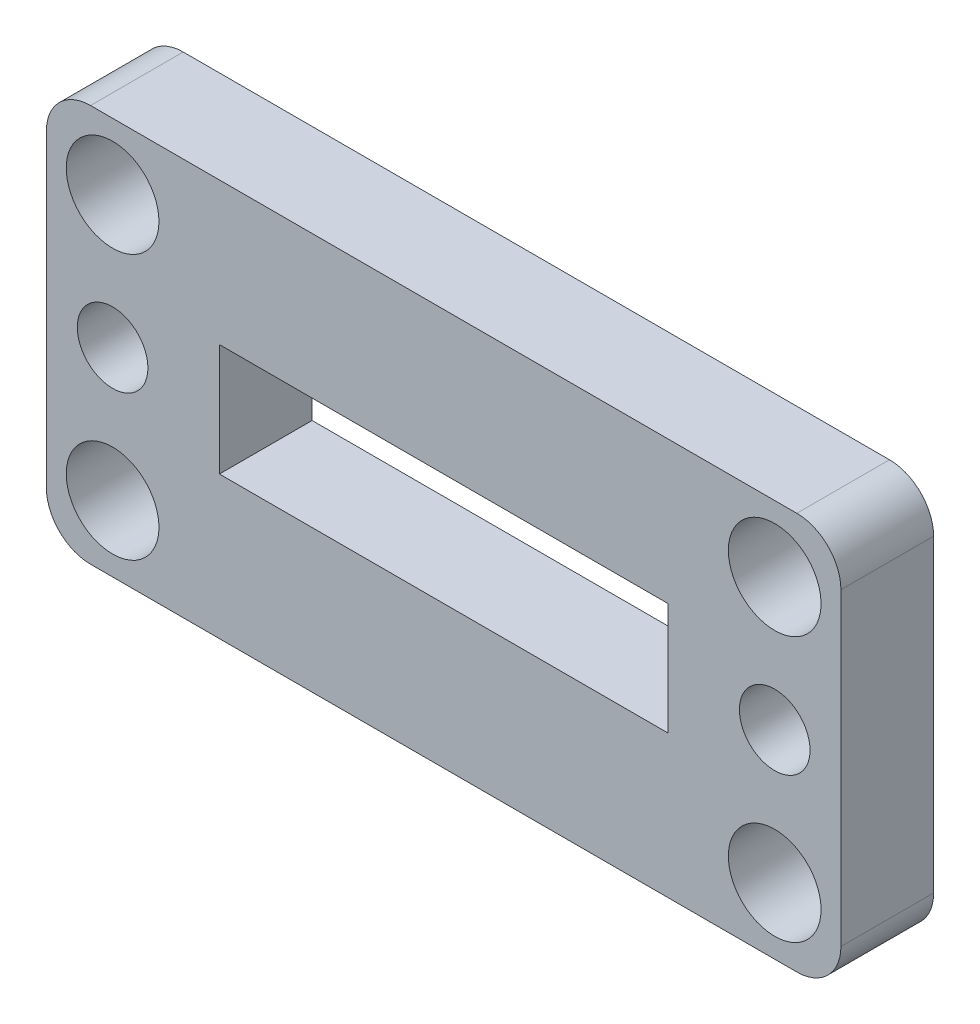
ISO-10303-21;
HEADER;
FILE_DESCRIPTION(('STEP AP214'),'2;1');
FILE_NAME('part.step','',(''),(''),'','','');
FILE_SCHEMA(('AUTOMOTIVE_DESIGN { 1 0 10303 214 1 1 1 1 }'));
ENDSEC;
DATA;
#1=APPLICATION_CONTEXT('core data for automotive mechanical design processes');
#2=APPLICATION_PROTOCOL_DEFINITION('international standard','automotive_design',2000,#1);
#3=PRODUCT_CONTEXT('',#1,'mechanical');
#4=PRODUCT('Part','Part','',(#3));
#5=PRODUCT_RELATED_PRODUCT_CATEGORY('part','',(#4));
#6=PRODUCT_DEFINITION_FORMATION('','',#4);
#7=PRODUCT_DEFINITION_CONTEXT('part definition',#1,'design');
#8=PRODUCT_DEFINITION('design','',#6,#7);
#9=PRODUCT_DEFINITION_SHAPE('','',#8);
#10=(LENGTH_UNIT() NAMED_UNIT(*) SI_UNIT(.MILLI.,.METRE.));
#11=(NAMED_UNIT(*) PLANE_ANGLE_UNIT() SI_UNIT($,.RADIAN.));
#12=(NAMED_UNIT(*) SI_UNIT($,.STERADIAN.) SOLID_ANGLE_UNIT());
#13=UNCERTAINTY_MEASURE_WITH_UNIT(LENGTH_MEASURE(1.E-05),#10,'distance_accuracy_value','');
#14=(GEOMETRIC_REPRESENTATION_CONTEXT(3) GLOBAL_UNCERTAINTY_ASSIGNED_CONTEXT((#13)) GLOBAL_UNIT_ASSIGNED_CONTEXT((#10,
#11,#12)) REPRESENTATION_CONTEXT('',''));
#15=CARTESIAN_POINT('',(0.,0.,0.));
#16=DIRECTION('',(0.,0.,1.));
#17=DIRECTION('',(1.,0.,0.));
#18=AXIS2_PLACEMENT_3D('',#15,#16,#17);
#19=CARTESIAN_POINT('',(16.,7.,4.2));
#20=DIRECTION('',(0.,0.,1.));
#21=DIRECTION('',(1.,0.,0.));
#22=AXIS2_PLACEMENT_3D('',#19,#20,#21);
#23=PLANE('',#22);
#24=CARTESIAN_POINT('',(-15.,-6.,4.2));
#25=DIRECTION('',(0.,0.,1.));
#26=DIRECTION('',(-1.,0.,0.));
#27=AXIS2_PLACEMENT_3D('',#24,#25,#26);
#28=CIRCLE('',#27,2.09999999999999);
#29=CARTESIAN_POINT('',(-17.1,-6.,4.2));
#30=VERTEX_POINT('',#29);
#31=EDGE_CURVE('E158',#30,#30,#28,.T.);
#32=ORIENTED_EDGE('',*,*,#31,.F.);
#33=EDGE_LOOP('',(#32));
#34=FACE_BOUND('',#33,.T.);
#35=CARTESIAN_POINT('',(15.,6.,4.2));
#36=DIRECTION('',(0.,0.,1.));
#37=DIRECTION('',(-1.,0.,0.));
#38=AXIS2_PLACEMENT_3D('',#35,#36,#37);
#39=CIRCLE('',#38,2.1);
#40=CARTESIAN_POINT('',(12.9,6.,4.2));
#41=VERTEX_POINT('',#40);
#42=EDGE_CURVE('E170',#41,#41,#39,.T.);
#43=ORIENTED_EDGE('',*,*,#42,.F.);
#44=EDGE_LOOP('',(#43));
#45=FACE_BOUND('',#44,.T.);
#46=CARTESIAN_POINT('',(14.9999999999864,3.40841457442923E-12,4.2));
#47=DIRECTION('',(0.,0.,1.));
#48=DIRECTION('',(1.,0.,0.));
#49=AXIS2_PLACEMENT_3D('',#46,#47,#48);
#50=CIRCLE('',#49,1.599999999999);
#51=CARTESIAN_POINT('',(16.5999999999854,3.40841457442923E-12,4.2));
#52=VERTEX_POINT('',#51);
#53=EDGE_CURVE('E182',#52,#52,#50,.T.);
#54=ORIENTED_EDGE('',*,*,#53,.F.);
#55=EDGE_LOOP('',(#54));
#56=FACE_BOUND('',#55,.T.);
#57=CARTESIAN_POINT('',(16.,7.,4.2));
#58=DIRECTION('',(0.,0.,1.));
#59=DIRECTION('',(1.,0.,0.));
#60=AXIS2_PLACEMENT_3D('',#57,#58,#59);
#61=CIRCLE('',#60,2.);
#62=CARTESIAN_POINT('',(18.,7.,4.2));
#63=VERTEX_POINT('',#62);
#64=CARTESIAN_POINT('',(16.,9.,4.2));
#65=VERTEX_POINT('',#64);
#66=EDGE_CURVE('E194',#63,#65,#61,.T.);
#67=ORIENTED_EDGE('',*,*,#66,.T.);
#68=DIRECTION('',(-1.,0.,0.));
#69=VECTOR('',#68,1.);
#70=CARTESIAN_POINT('',(16.,9.,4.2));
#71=LINE('',#70,#69);
#72=CARTESIAN_POINT('',(-16.,8.99999999999999,4.2));
#73=VERTEX_POINT('',#72);
#74=EDGE_CURVE('E197',#65,#73,#71,.T.);
#75=ORIENTED_EDGE('',*,*,#74,.T.);
#76=CARTESIAN_POINT('',(-16.,7.,4.2));
#77=DIRECTION('',(0.,0.,1.));
#78=DIRECTION('',(1.,0.,0.));
#79=AXIS2_PLACEMENT_3D('',#76,#77,#78);
#80=CIRCLE('',#79,2.);
#81=CARTESIAN_POINT('',(-18.,7.,4.2));
#82=VERTEX_POINT('',#81);
#83=EDGE_CURVE('E200',#73,#82,#80,.T.);
#84=ORIENTED_EDGE('',*,*,#83,.T.);
#85=DIRECTION('',(0.,-1.,0.));
#86=VECTOR('',#85,1.);
#87=CARTESIAN_POINT('',(-18.,-7.,4.2));
#88=LINE('',#87,#86);
#89=CARTESIAN_POINT('',(-18.,-7.,4.2));
#90=VERTEX_POINT('',#89);
#91=EDGE_CURVE('E202',#82,#90,#88,.T.);
#92=ORIENTED_EDGE('',*,*,#91,.T.);
#93=CARTESIAN_POINT('',(-16.,-7.,4.2));
#94=DIRECTION('',(0.,0.,1.));
#95=DIRECTION('',(1.,0.,0.));
#96=AXIS2_PLACEMENT_3D('',#93,#94,#95);
#97=CIRCLE('',#96,2.);
#98=CARTESIAN_POINT('',(-16.,-9.,4.2));
#99=VERTEX_POINT('',#98);
#100=EDGE_CURVE('E204',#90,#99,#97,.T.);
#101=ORIENTED_EDGE('',*,*,#100,.T.);
#102=DIRECTION('',(1.,0.,0.));
#103=VECTOR('',#102,1.);
#104=CARTESIAN_POINT('',(16.,-9.,4.2));
#105=LINE('',#104,#103);
#106=CARTESIAN_POINT('',(16.,-9.,4.2));
#107=VERTEX_POINT('',#106);
#108=EDGE_CURVE('E206',#99,#107,#105,.T.);
#109=ORIENTED_EDGE('',*,*,#108,.T.);
#110=CARTESIAN_POINT('',(16.,-7.,4.2));
#111=DIRECTION('',(0.,0.,1.));
#112=DIRECTION('',(1.,0.,0.));
#113=AXIS2_PLACEMENT_3D('',#110,#111,#112);
#114=CIRCLE('',#113,2.);
#115=CARTESIAN_POINT('',(18.,-7.,4.2));
#116=VERTEX_POINT('',#115);
#117=EDGE_CURVE('E208',#107,#116,#114,.T.);
#118=ORIENTED_EDGE('',*,*,#117,.T.);
#119=DIRECTION('',(0.,1.,0.));
#120=VECTOR('',#119,1.);
#121=CARTESIAN_POINT('',(18.,-7.,4.2));
#122=LINE('',#121,#120);
#123=EDGE_CURVE('E210',#116,#63,#122,.T.);
#124=ORIENTED_EDGE('',*,*,#123,.T.);
#125=EDGE_LOOP('',(#67,#75,#84,#92,#101,#109,#118,#124));
#126=FACE_BOUND('',#125,.T.);
#127=CARTESIAN_POINT('',(-14.9999999999864,3.40474063403179E-12,4.2));
#128=DIRECTION('',(0.,0.,1.));
#129=DIRECTION('',(1.,0.,0.));
#130=AXIS2_PLACEMENT_3D('',#127,#128,#129);
#131=CIRCLE('',#130,1.59999999999901);
#132=CARTESIAN_POINT('',(-13.3999999999873,3.40474063403179E-12,4.2));
#133=VERTEX_POINT('',#132);
#134=EDGE_CURVE('E188',#133,#133,#131,.T.);
#135=ORIENTED_EDGE('',*,*,#134,.F.);
#136=EDGE_LOOP('',(#135));
#137=FACE_BOUND('',#136,.T.);
#138=CARTESIAN_POINT('',(-15.,6.,4.2));
#139=DIRECTION('',(0.,0.,1.));
#140=DIRECTION('',(1.,0.,0.));
#141=AXIS2_PLACEMENT_3D('',#138,#139,#140);
#142=CIRCLE('',#141,2.1);
#143=CARTESIAN_POINT('',(-12.9,6.,4.2));
#144=VERTEX_POINT('',#143);
#145=EDGE_CURVE('E176',#144,#144,#142,.T.);
#146=ORIENTED_EDGE('',*,*,#145,.F.);
#147=EDGE_LOOP('',(#146));
#148=FACE_BOUND('',#147,.T.);
#149=CARTESIAN_POINT('',(15.,-5.99999999999999,4.2));
#150=DIRECTION('',(0.,0.,1.));
#151=DIRECTION('',(1.,0.,0.));
#152=AXIS2_PLACEMENT_3D('',#149,#150,#151);
#153=CIRCLE('',#152,2.1);
#154=CARTESIAN_POINT('',(17.1,-5.99999999999999,4.2));
#155=VERTEX_POINT('',#154);
#156=EDGE_CURVE('E164',#155,#155,#153,.T.);
#157=ORIENTED_EDGE('',*,*,#156,.F.);
#158=EDGE_LOOP('',(#157));
#159=FACE_BOUND('',#158,.T.);
#160=DIRECTION('',(-1.,0.,0.));
#161=VECTOR('',#160,1.);
#162=CARTESIAN_POINT('',(10.16,2.53999999999999,4.2));
#163=LINE('',#162,#161);
#164=CARTESIAN_POINT('',(10.16,2.53999999999999,4.2));
#165=VERTEX_POINT('',#164);
#166=CARTESIAN_POINT('',(-10.16,2.54,4.2));
#167=VERTEX_POINT('',#166);
#168=EDGE_CURVE('E130',#165,#167,#163,.T.);
#169=ORIENTED_EDGE('',*,*,#168,.F.);
#170=DIRECTION('',(0.,1.,0.));
#171=VECTOR('',#170,1.);
#172=CARTESIAN_POINT('',(10.16,-2.54,4.2));
#173=LINE('',#172,#171);
#174=CARTESIAN_POINT('',(10.16,-2.54,4.2));
#175=VERTEX_POINT('',#174);
#176=EDGE_CURVE('E122',#175,#165,#173,.T.);
#177=ORIENTED_EDGE('',*,*,#176,.F.);
#178=DIRECTION('',(1.,0.,0.));
#179=VECTOR('',#178,1.);
#180=CARTESIAN_POINT('',(10.16,-2.54,4.2));
#181=LINE('',#180,#179);
#182=CARTESIAN_POINT('',(-10.16,-2.54,4.2));
#183=VERTEX_POINT('',#182);
#184=EDGE_CURVE('E144',#183,#175,#181,.T.);
#185=ORIENTED_EDGE('',*,*,#184,.F.);
#186=DIRECTION('',(0.,-1.,0.));
#187=VECTOR('',#186,1.);
#188=CARTESIAN_POINT('',(-10.16,-2.54,4.2));
#189=LINE('',#188,#187);
#190=EDGE_CURVE('E142',#167,#183,#189,.T.);
#191=ORIENTED_EDGE('',*,*,#190,.F.);
#192=EDGE_LOOP('',(#169,#177,#185,#191));
#193=FACE_BOUND('',#192,.T.);
#194=ADVANCED_FACE('F33',(#34,#45,#56,#126,#137,#148,#159,#193),#23,.T.);
#195=CARTESIAN_POINT('',(16.,7.,0.));
#196=DIRECTION('',(0.,0.,1.));
#197=DIRECTION('',(1.,0.,0.));
#198=AXIS2_PLACEMENT_3D('',#195,#196,#197);
#199=PLANE('',#198);
#200=CARTESIAN_POINT('',(-15.,-6.,0.));
#201=DIRECTION('',(0.,0.,1.));
#202=DIRECTION('',(-1.,0.,0.));
#203=AXIS2_PLACEMENT_3D('',#200,#201,#202);
#204=CIRCLE('',#203,2.09999999999999);
#205=CARTESIAN_POINT('',(-17.1,-6.,0.));
#206=VERTEX_POINT('',#205);
#207=EDGE_CURVE('E138',#206,#206,#204,.T.);
#208=ORIENTED_EDGE('',*,*,#207,.T.);
#209=EDGE_LOOP('',(#208));
#210=FACE_BOUND('',#209,.T.);
#211=CARTESIAN_POINT('',(15.,6.,0.));
#212=DIRECTION('',(0.,0.,1.));
#213=DIRECTION('',(-1.,0.,0.));
#214=AXIS2_PLACEMENT_3D('',#211,#212,#213);
#215=CIRCLE('',#214,2.1);
#216=CARTESIAN_POINT('',(12.9,6.,0.));
#217=VERTEX_POINT('',#216);
#218=EDGE_CURVE('E167',#217,#217,#215,.T.);
#219=ORIENTED_EDGE('',*,*,#218,.T.);
#220=EDGE_LOOP('',(#219));
#221=FACE_BOUND('',#220,.T.);
#222=CARTESIAN_POINT('',(14.9999999999864,3.40841457442923E-12,0.));
#223=DIRECTION('',(0.,0.,1.));
#224=DIRECTION('',(1.,0.,0.));
#225=AXIS2_PLACEMENT_3D('',#222,#223,#224);
#226=CIRCLE('',#225,1.599999999999);
#227=CARTESIAN_POINT('',(16.5999999999854,3.40841457442923E-12,0.));
#228=VERTEX_POINT('',#227);
#229=EDGE_CURVE('E179',#228,#228,#226,.T.);
#230=ORIENTED_EDGE('',*,*,#229,.T.);
#231=EDGE_LOOP('',(#230));
#232=FACE_BOUND('',#231,.T.);
#233=CARTESIAN_POINT('',(16.,7.,0.));
#234=DIRECTION('',(0.,0.,1.));
#235=DIRECTION('',(1.,0.,0.));
#236=AXIS2_PLACEMENT_3D('',#233,#234,#235);
#237=CIRCLE('',#236,2.);
#238=CARTESIAN_POINT('',(18.,7.,0.));
#239=VERTEX_POINT('',#238);
#240=CARTESIAN_POINT('',(16.,9.,0.));
#241=VERTEX_POINT('',#240);
#242=EDGE_CURVE('E191',#239,#241,#237,.T.);
#243=ORIENTED_EDGE('',*,*,#242,.F.);
#244=DIRECTION('',(0.,1.,0.));
#245=VECTOR('',#244,1.);
#246=CARTESIAN_POINT('',(18.,-7.,0.));
#247=LINE('',#246,#245);
#248=CARTESIAN_POINT('',(18.,-7.,0.));
#249=VERTEX_POINT('',#248);
#250=EDGE_CURVE('E198',#249,#239,#247,.T.);
#251=ORIENTED_EDGE('',*,*,#250,.F.);
#252=CARTESIAN_POINT('',(16.,-7.,0.));
#253=DIRECTION('',(0.,0.,1.));
#254=DIRECTION('',(1.,0.,0.));
#255=AXIS2_PLACEMENT_3D('',#252,#253,#254);
#256=CIRCLE('',#255,2.);
#257=CARTESIAN_POINT('',(16.,-9.,0.));
#258=VERTEX_POINT('',#257);
#259=EDGE_CURVE('E225',#258,#249,#256,.T.);
#260=ORIENTED_EDGE('',*,*,#259,.F.);
#261=DIRECTION('',(1.,0.,0.));
#262=VECTOR('',#261,1.);
#263=CARTESIAN_POINT('',(16.,-9.,0.));
#264=LINE('',#263,#262);
#265=CARTESIAN_POINT('',(-16.,-9.,0.));
#266=VERTEX_POINT('',#265);
#267=EDGE_CURVE('E223',#266,#258,#264,.T.);
#268=ORIENTED_EDGE('',*,*,#267,.F.);
#269=CARTESIAN_POINT('',(-16.,-7.,0.));
#270=DIRECTION('',(0.,0.,1.));
#271=DIRECTION('',(1.,0.,0.));
#272=AXIS2_PLACEMENT_3D('',#269,#270,#271);
#273=CIRCLE('',#272,2.);
#274=CARTESIAN_POINT('',(-18.,-7.,0.));
#275=VERTEX_POINT('',#274);
#276=EDGE_CURVE('E221',#275,#266,#273,.T.);
#277=ORIENTED_EDGE('',*,*,#276,.F.);
#278=DIRECTION('',(0.,-1.,0.));
#279=VECTOR('',#278,1.);
#280=CARTESIAN_POINT('',(-18.,-7.,0.));
#281=LINE('',#280,#279);
#282=CARTESIAN_POINT('',(-18.,7.,0.));
#283=VERTEX_POINT('',#282);
#284=EDGE_CURVE('E219',#283,#275,#281,.T.);
#285=ORIENTED_EDGE('',*,*,#284,.F.);
#286=CARTESIAN_POINT('',(-16.,7.,0.));
#287=DIRECTION('',(0.,0.,1.));
#288=DIRECTION('',(1.,0.,0.));
#289=AXIS2_PLACEMENT_3D('',#286,#287,#288);
#290=CIRCLE('',#289,2.);
#291=CARTESIAN_POINT('',(-16.,8.99999999999999,0.));
#292=VERTEX_POINT('',#291);
#293=EDGE_CURVE('E217',#292,#283,#290,.T.);
#294=ORIENTED_EDGE('',*,*,#293,.F.);
#295=DIRECTION('',(-1.,0.,0.));
#296=VECTOR('',#295,1.);
#297=CARTESIAN_POINT('',(16.,9.,0.));
#298=LINE('',#297,#296);
#299=EDGE_CURVE('E215',#241,#292,#298,.T.);
#300=ORIENTED_EDGE('',*,*,#299,.F.);
#301=EDGE_LOOP('',(#243,#251,#260,#268,#277,#285,#294,#300));
#302=FACE_BOUND('',#301,.T.);
#303=CARTESIAN_POINT('',(-14.9999999999864,3.40474063403179E-12,0.));
#304=DIRECTION('',(0.,0.,1.));
#305=DIRECTION('',(1.,0.,0.));
#306=AXIS2_PLACEMENT_3D('',#303,#304,#305);
#307=CIRCLE('',#306,1.59999999999901);
#308=CARTESIAN_POINT('',(-13.3999999999873,3.40474063403179E-12,0.));
#309=VERTEX_POINT('',#308);
#310=EDGE_CURVE('E185',#309,#309,#307,.T.);
#311=ORIENTED_EDGE('',*,*,#310,.T.);
#312=EDGE_LOOP('',(#311));
#313=FACE_BOUND('',#312,.T.);
#314=CARTESIAN_POINT('',(-15.,6.,0.));
#315=DIRECTION('',(0.,0.,1.));
#316=DIRECTION('',(1.,0.,0.));
#317=AXIS2_PLACEMENT_3D('',#314,#315,#316);
#318=CIRCLE('',#317,2.1);
#319=CARTESIAN_POINT('',(-12.9,6.,0.));
#320=VERTEX_POINT('',#319);
#321=EDGE_CURVE('E173',#320,#320,#318,.T.);
#322=ORIENTED_EDGE('',*,*,#321,.T.);
#323=EDGE_LOOP('',(#322));
#324=FACE_BOUND('',#323,.T.);
#325=CARTESIAN_POINT('',(15.,-5.99999999999999,0.));
#326=DIRECTION('',(0.,0.,1.));
#327=DIRECTION('',(1.,0.,0.));
#328=AXIS2_PLACEMENT_3D('',#325,#326,#327);
#329=CIRCLE('',#328,2.1);
#330=CARTESIAN_POINT('',(17.1,-5.99999999999999,0.));
#331=VERTEX_POINT('',#330);
#332=EDGE_CURVE('E161',#331,#331,#329,.T.);
#333=ORIENTED_EDGE('',*,*,#332,.T.);
#334=EDGE_LOOP('',(#333));
#335=FACE_BOUND('',#334,.T.);
#336=DIRECTION('',(0.,1.,0.));
#337=VECTOR('',#336,1.);
#338=CARTESIAN_POINT('',(10.16,-2.54,0.));
#339=LINE('',#338,#337);
#340=CARTESIAN_POINT('',(10.16,-2.54,0.));
#341=VERTEX_POINT('',#340);
#342=CARTESIAN_POINT('',(10.16,2.53999999999999,0.));
#343=VERTEX_POINT('',#342);
#344=EDGE_CURVE('E56',#341,#343,#339,.T.);
#345=ORIENTED_EDGE('',*,*,#344,.T.);
#346=DIRECTION('',(-1.,0.,0.));
#347=VECTOR('',#346,1.);
#348=CARTESIAN_POINT('',(10.16,2.53999999999999,0.));
#349=LINE('',#348,#347);
#350=CARTESIAN_POINT('',(-10.16,2.54,0.));
#351=VERTEX_POINT('',#350);
#352=EDGE_CURVE('E137',#343,#351,#349,.T.);
#353=ORIENTED_EDGE('',*,*,#352,.T.);
#354=DIRECTION('',(0.,-1.,0.));
#355=VECTOR('',#354,1.);
#356=CARTESIAN_POINT('',(-10.16,-2.54,0.));
#357=LINE('',#356,#355);
#358=CARTESIAN_POINT('',(-10.16,-2.54,0.));
#359=VERTEX_POINT('',#358);
#360=EDGE_CURVE('E150',#351,#359,#357,.T.);
#361=ORIENTED_EDGE('',*,*,#360,.T.);
#362=DIRECTION('',(1.,0.,0.));
#363=VECTOR('',#362,1.);
#364=CARTESIAN_POINT('',(10.16,-2.54,0.));
#365=LINE('',#364,#363);
#366=EDGE_CURVE('E131',#359,#341,#365,.T.);
#367=ORIENTED_EDGE('',*,*,#366,.T.);
#368=EDGE_LOOP('',(#345,#353,#361,#367));
#369=FACE_BOUND('',#368,.T.);
#370=ADVANCED_FACE('F255',(#210,#221,#232,#302,#313,#324,#335,#369),#199,.F.);
#371=CARTESIAN_POINT('',(16.,7.,4.2));
#372=DIRECTION('',(0.,0.,-1.));
#373=DIRECTION('',(-1.,0.,0.));
#374=AXIS2_PLACEMENT_3D('',#371,#372,#373);
#375=CYLINDRICAL_SURFACE('',#374,2.);
#376=ORIENTED_EDGE('',*,*,#242,.T.);
#377=DIRECTION('',(0.,0.,-1.));
#378=VECTOR('',#377,1.);
#379=CARTESIAN_POINT('',(16.,9.,4.2));
#380=LINE('',#379,#378);
#381=EDGE_CURVE('E11',#65,#241,#380,.T.);
#382=ORIENTED_EDGE('',*,*,#381,.F.);
#383=ORIENTED_EDGE('',*,*,#66,.F.);
#384=DIRECTION('',(0.,0.,-1.));
#385=VECTOR('',#384,1.);
#386=CARTESIAN_POINT('',(18.,7.,4.2));
#387=LINE('',#386,#385);
#388=EDGE_CURVE('E212',#63,#239,#387,.T.);
#389=ORIENTED_EDGE('',*,*,#388,.T.);
#390=EDGE_LOOP('',(#376,#382,#383,#389));
#391=FACE_BOUND('',#390,.T.);
#392=ADVANCED_FACE('F35',(#391),#375,.T.);
#393=CARTESIAN_POINT('',(16.,9.,4.2));
#394=DIRECTION('',(0.,-1.,0.));
#395=DIRECTION('',(1.,0.,0.));
#396=AXIS2_PLACEMENT_3D('',#393,#394,#395);
#397=PLANE('',#396);
#398=ORIENTED_EDGE('',*,*,#299,.T.);
#399=DIRECTION('',(0.,0.,-1.));
#400=VECTOR('',#399,1.);
#401=CARTESIAN_POINT('',(-16.,8.99999999999999,4.2));
#402=LINE('',#401,#400);
#403=EDGE_CURVE('E41',#73,#292,#402,.T.);
#404=ORIENTED_EDGE('',*,*,#403,.F.);
#405=ORIENTED_EDGE('',*,*,#74,.F.);
#406=ORIENTED_EDGE('',*,*,#381,.T.);
#407=EDGE_LOOP('',(#398,#404,#405,#406));
#408=FACE_BOUND('',#407,.T.);
#409=ADVANCED_FACE('F273',(#408),#397,.F.);
#410=CARTESIAN_POINT('',(-16.,7.,4.2));
#411=DIRECTION('',(0.,0.,-1.));
#412=DIRECTION('',(-1.,0.,0.));
#413=AXIS2_PLACEMENT_3D('',#410,#411,#412);
#414=CYLINDRICAL_SURFACE('',#413,2.);
#415=ORIENTED_EDGE('',*,*,#293,.T.);
#416=DIRECTION('',(0.,0.,-1.));
#417=VECTOR('',#416,1.);
#418=CARTESIAN_POINT('',(-18.,7.,4.2));
#419=LINE('',#418,#417);
#420=EDGE_CURVE('E242',#82,#283,#419,.T.);
#421=ORIENTED_EDGE('',*,*,#420,.F.);
#422=ORIENTED_EDGE('',*,*,#83,.F.);
#423=ORIENTED_EDGE('',*,*,#403,.T.);
#424=EDGE_LOOP('',(#415,#421,#422,#423));
#425=FACE_BOUND('',#424,.T.);
#426=ADVANCED_FACE('F249',(#425),#414,.T.);
#427=CARTESIAN_POINT('',(-18.,-7.,4.2));
#428=DIRECTION('',(1.,0.,0.));
#429=DIRECTION('',(0.,0.,-1.));
#430=AXIS2_PLACEMENT_3D('',#427,#428,#429);
#431=PLANE('',#430);
#432=ORIENTED_EDGE('',*,*,#284,.T.);
#433=DIRECTION('',(0.,0.,-1.));
#434=VECTOR('',#433,1.);
#435=CARTESIAN_POINT('',(-18.,-7.,4.2));
#436=LINE('',#435,#434);
#437=EDGE_CURVE('E239',#90,#275,#436,.T.);
#438=ORIENTED_EDGE('',*,*,#437,.F.);
#439=ORIENTED_EDGE('',*,*,#91,.F.);
#440=ORIENTED_EDGE('',*,*,#420,.T.);
#441=EDGE_LOOP('',(#432,#438,#439,#440));
#442=FACE_BOUND('',#441,.T.);
#443=ADVANCED_FACE('F261',(#442),#431,.F.);
#444=CARTESIAN_POINT('',(-16.,-7.,4.2));
#445=DIRECTION('',(0.,0.,-1.));
#446=DIRECTION('',(-1.,0.,0.));
#447=AXIS2_PLACEMENT_3D('',#444,#445,#446);
#448=CYLINDRICAL_SURFACE('',#447,2.);
#449=ORIENTED_EDGE('',*,*,#276,.T.);
#450=DIRECTION('',(0.,0.,-1.));
#451=VECTOR('',#450,1.);
#452=CARTESIAN_POINT('',(-16.,-9.,4.2));
#453=LINE('',#452,#451);
#454=EDGE_CURVE('E236',#99,#266,#453,.T.);
#455=ORIENTED_EDGE('',*,*,#454,.F.);
#456=ORIENTED_EDGE('',*,*,#100,.F.);
#457=ORIENTED_EDGE('',*,*,#437,.T.);
#458=EDGE_LOOP('',(#449,#455,#456,#457));
#459=FACE_BOUND('',#458,.T.);
#460=ADVANCED_FACE('F265',(#459),#448,.T.);
#461=CARTESIAN_POINT('',(16.,-9.,4.2));
#462=DIRECTION('',(0.,1.,0.));
#463=DIRECTION('',(0.,0.,1.));
#464=AXIS2_PLACEMENT_3D('',#461,#462,#463);
#465=PLANE('',#464);
#466=ORIENTED_EDGE('',*,*,#267,.T.);
#467=DIRECTION('',(0.,0.,-1.));
#468=VECTOR('',#467,1.);
#469=CARTESIAN_POINT('',(16.,-9.,4.2));
#470=LINE('',#469,#468);
#471=EDGE_CURVE('E233',#107,#258,#470,.T.);
#472=ORIENTED_EDGE('',*,*,#471,.F.);
#473=ORIENTED_EDGE('',*,*,#108,.F.);
#474=ORIENTED_EDGE('',*,*,#454,.T.);
#475=EDGE_LOOP('',(#466,#472,#473,#474));
#476=FACE_BOUND('',#475,.T.);
#477=ADVANCED_FACE('F286',(#476),#465,.F.);
#478=CARTESIAN_POINT('',(16.,-7.,4.2));
#479=DIRECTION('',(0.,0.,-1.));
#480=DIRECTION('',(-1.,0.,0.));
#481=AXIS2_PLACEMENT_3D('',#478,#479,#480);
#482=CYLINDRICAL_SURFACE('',#481,2.);
#483=ORIENTED_EDGE('',*,*,#259,.T.);
#484=DIRECTION('',(0.,0.,-1.));
#485=VECTOR('',#484,1.);
#486=CARTESIAN_POINT('',(18.,-7.,4.2));
#487=LINE('',#486,#485);
#488=EDGE_CURVE('E230',#116,#249,#487,.T.);
#489=ORIENTED_EDGE('',*,*,#488,.F.);
#490=ORIENTED_EDGE('',*,*,#117,.F.);
#491=ORIENTED_EDGE('',*,*,#471,.T.);
#492=EDGE_LOOP('',(#483,#489,#490,#491));
#493=FACE_BOUND('',#492,.T.);
#494=ADVANCED_FACE('F284',(#493),#482,.T.);
#495=CARTESIAN_POINT('',(18.,-7.,4.2));
#496=DIRECTION('',(-1.,0.,0.));
#497=DIRECTION('',(0.,0.,1.));
#498=AXIS2_PLACEMENT_3D('',#495,#496,#497);
#499=PLANE('',#498);
#500=ORIENTED_EDGE('',*,*,#250,.T.);
#501=ORIENTED_EDGE('',*,*,#388,.F.);
#502=ORIENTED_EDGE('',*,*,#123,.F.);
#503=ORIENTED_EDGE('',*,*,#488,.T.);
#504=EDGE_LOOP('',(#500,#501,#502,#503));
#505=FACE_BOUND('',#504,.T.);
#506=ADVANCED_FACE('F279',(#505),#499,.F.);
#507=CARTESIAN_POINT('',(-14.9999999999864,3.40474063403179E-12,4.2));
#508=DIRECTION('',(0.,0.,-1.));
#509=DIRECTION('',(-1.,0.,0.));
#510=AXIS2_PLACEMENT_3D('',#507,#508,#509);
#511=CYLINDRICAL_SURFACE('',#510,1.59999999999901);
#512=ORIENTED_EDGE('',*,*,#134,.T.);
#513=EDGE_LOOP('',(#512));
#514=FACE_BOUND('',#513,.T.);
#515=ORIENTED_EDGE('',*,*,#310,.F.);
#516=EDGE_LOOP('',(#515));
#517=FACE_BOUND('',#516,.T.);
#518=ADVANCED_FACE('F306',(#514,#517),#511,.F.);
#519=CARTESIAN_POINT('',(14.9999999999864,3.40841457442923E-12,4.2));
#520=DIRECTION('',(0.,0.,-1.));
#521=DIRECTION('',(-1.,0.,0.));
#522=AXIS2_PLACEMENT_3D('',#519,#520,#521);
#523=CYLINDRICAL_SURFACE('',#522,1.599999999999);
#524=ORIENTED_EDGE('',*,*,#53,.T.);
#525=EDGE_LOOP('',(#524));
#526=FACE_BOUND('',#525,.T.);
#527=ORIENTED_EDGE('',*,*,#229,.F.);
#528=EDGE_LOOP('',(#527));
#529=FACE_BOUND('',#528,.T.);
#530=ADVANCED_FACE('F313',(#526,#529),#523,.F.);
#531=CARTESIAN_POINT('',(-15.,6.,4.2));
#532=DIRECTION('',(0.,0.,-1.));
#533=DIRECTION('',(-1.,0.,0.));
#534=AXIS2_PLACEMENT_3D('',#531,#532,#533);
#535=CYLINDRICAL_SURFACE('',#534,2.1);
#536=ORIENTED_EDGE('',*,*,#145,.T.);
#537=EDGE_LOOP('',(#536));
#538=FACE_BOUND('',#537,.T.);
#539=ORIENTED_EDGE('',*,*,#321,.F.);
#540=EDGE_LOOP('',(#539));
#541=FACE_BOUND('',#540,.T.);
#542=ADVANCED_FACE('F318',(#538,#541),#535,.F.);
#543=CARTESIAN_POINT('',(15.,6.,4.2));
#544=DIRECTION('',(0.,0.,-1.));
#545=DIRECTION('',(-1.,0.,0.));
#546=AXIS2_PLACEMENT_3D('',#543,#544,#545);
#547=CYLINDRICAL_SURFACE('',#546,2.1);
#548=ORIENTED_EDGE('',*,*,#42,.T.);
#549=EDGE_LOOP('',(#548));
#550=FACE_BOUND('',#549,.T.);
#551=ORIENTED_EDGE('',*,*,#218,.F.);
#552=EDGE_LOOP('',(#551));
#553=FACE_BOUND('',#552,.T.);
#554=ADVANCED_FACE('F350',(#550,#553),#547,.F.);
#555=CARTESIAN_POINT('',(15.,-5.99999999999999,4.2));
#556=DIRECTION('',(0.,0.,-1.));
#557=DIRECTION('',(-1.,0.,0.));
#558=AXIS2_PLACEMENT_3D('',#555,#556,#557);
#559=CYLINDRICAL_SURFACE('',#558,2.1);
#560=ORIENTED_EDGE('',*,*,#156,.T.);
#561=EDGE_LOOP('',(#560));
#562=FACE_BOUND('',#561,.T.);
#563=ORIENTED_EDGE('',*,*,#332,.F.);
#564=EDGE_LOOP('',(#563));
#565=FACE_BOUND('',#564,.T.);
#566=ADVANCED_FACE('F346',(#562,#565),#559,.F.);
#567=CARTESIAN_POINT('',(-15.,-6.,4.2));
#568=DIRECTION('',(0.,0.,-1.));
#569=DIRECTION('',(-1.,0.,0.));
#570=AXIS2_PLACEMENT_3D('',#567,#568,#569);
#571=CYLINDRICAL_SURFACE('',#570,2.09999999999999);
#572=ORIENTED_EDGE('',*,*,#31,.T.);
#573=EDGE_LOOP('',(#572));
#574=FACE_BOUND('',#573,.T.);
#575=ORIENTED_EDGE('',*,*,#207,.F.);
#576=EDGE_LOOP('',(#575));
#577=FACE_BOUND('',#576,.T.);
#578=ADVANCED_FACE('F343',(#574,#577),#571,.F.);
#579=CARTESIAN_POINT('',(10.16,-2.54,4.2));
#580=DIRECTION('',(-1.,0.,0.));
#581=DIRECTION('',(0.,0.,1.));
#582=AXIS2_PLACEMENT_3D('',#579,#580,#581);
#583=PLANE('',#582);
#584=ORIENTED_EDGE('',*,*,#344,.F.);
#585=DIRECTION('',(0.,0.,-1.));
#586=VECTOR('',#585,1.);
#587=CARTESIAN_POINT('',(10.16,-2.54,4.2));
#588=LINE('',#587,#586);
#589=EDGE_CURVE('E126',#175,#341,#588,.T.);
#590=ORIENTED_EDGE('',*,*,#589,.F.);
#591=ORIENTED_EDGE('',*,*,#176,.T.);
#592=DIRECTION('',(0.,0.,-1.));
#593=VECTOR('',#592,1.);
#594=CARTESIAN_POINT('',(10.16,2.53999999999999,4.2));
#595=LINE('',#594,#593);
#596=EDGE_CURVE('E125',#165,#343,#595,.T.);
#597=ORIENTED_EDGE('',*,*,#596,.T.);
#598=EDGE_LOOP('',(#584,#590,#591,#597));
#599=FACE_BOUND('',#598,.T.);
#600=ADVANCED_FACE('F124',(#599),#583,.T.);
#601=CARTESIAN_POINT('',(10.16,2.53999999999999,4.2));
#602=DIRECTION('',(0.,-1.,0.));
#603=DIRECTION('',(1.,0.,0.));
#604=AXIS2_PLACEMENT_3D('',#601,#602,#603);
#605=PLANE('',#604);
#606=ORIENTED_EDGE('',*,*,#352,.F.);
#607=ORIENTED_EDGE('',*,*,#596,.F.);
#608=ORIENTED_EDGE('',*,*,#168,.T.);
#609=DIRECTION('',(0.,0.,-1.));
#610=VECTOR('',#609,1.);
#611=CARTESIAN_POINT('',(-10.16,2.54,4.2));
#612=LINE('',#611,#610);
#613=EDGE_CURVE('E139',#167,#351,#612,.T.);
#614=ORIENTED_EDGE('',*,*,#613,.T.);
#615=EDGE_LOOP('',(#606,#607,#608,#614));
#616=FACE_BOUND('',#615,.T.);
#617=ADVANCED_FACE('F134',(#616),#605,.T.);
#618=CARTESIAN_POINT('',(-10.16,-2.54,4.2));
#619=DIRECTION('',(1.,0.,0.));
#620=DIRECTION('',(0.,0.,-1.));
#621=AXIS2_PLACEMENT_3D('',#618,#619,#620);
#622=PLANE('',#621);
#623=ORIENTED_EDGE('',*,*,#360,.F.);
#624=ORIENTED_EDGE('',*,*,#613,.F.);
#625=ORIENTED_EDGE('',*,*,#190,.T.);
#626=DIRECTION('',(0.,0.,-1.));
#627=VECTOR('',#626,1.);
#628=CARTESIAN_POINT('',(-10.16,-2.54,4.2));
#629=LINE('',#628,#627);
#630=EDGE_CURVE('E48',#183,#359,#629,.T.);
#631=ORIENTED_EDGE('',*,*,#630,.T.);
#632=EDGE_LOOP('',(#623,#624,#625,#631));
#633=FACE_BOUND('',#632,.T.);
#634=ADVANCED_FACE('F331',(#633),#622,.T.);
#635=CARTESIAN_POINT('',(10.16,-2.54,4.2));
#636=DIRECTION('',(0.,1.,0.));
#637=DIRECTION('',(-1.,0.,0.));
#638=AXIS2_PLACEMENT_3D('',#635,#636,#637);
#639=PLANE('',#638);
#640=ORIENTED_EDGE('',*,*,#366,.F.);
#641=ORIENTED_EDGE('',*,*,#630,.F.);
#642=ORIENTED_EDGE('',*,*,#184,.T.);
#643=ORIENTED_EDGE('',*,*,#589,.T.);
#644=EDGE_LOOP('',(#640,#641,#642,#643));
#645=FACE_BOUND('',#644,.T.);
#646=ADVANCED_FACE('F329',(#645),#639,.T.);
#647=CLOSED_SHELL('',(#194,#370,#392,#409,#426,#443,#460,#477,#494,#506,#518,#530,#542,#554,
#566,#578,#600,#617,#634,#646));
#648=MANIFOLD_SOLID_BREP('B2',#647);
#649=ADVANCED_BREP_SHAPE_REPRESENTATION('',(#18,#648),#14);
#650=SHAPE_DEFINITION_REPRESENTATION(#9,#649);
ENDSEC;
END-ISO-10303-21;
